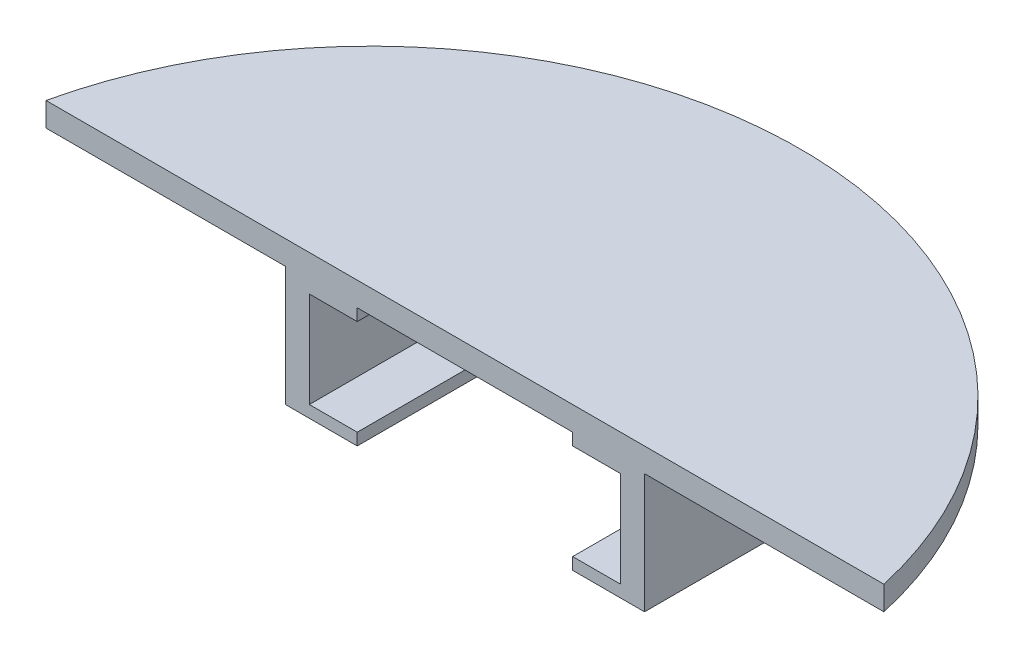
ISO-10303-21;
HEADER;
FILE_DESCRIPTION(('STEP AP214'),'2;1');
FILE_NAME('part.step','',(''),(''),'','','');
FILE_SCHEMA(('AUTOMOTIVE_DESIGN { 1 0 10303 214 1 1 1 1 }'));
ENDSEC;
DATA;
#1=APPLICATION_CONTEXT('core data for automotive mechanical design processes');
#2=APPLICATION_PROTOCOL_DEFINITION('international standard','automotive_design',2000,#1);
#3=PRODUCT_CONTEXT('',#1,'mechanical');
#4=PRODUCT('Part','Part','',(#3));
#5=PRODUCT_RELATED_PRODUCT_CATEGORY('part','',(#4));
#6=PRODUCT_DEFINITION_FORMATION('','',#4);
#7=PRODUCT_DEFINITION_CONTEXT('part definition',#1,'design');
#8=PRODUCT_DEFINITION('design','',#6,#7);
#9=PRODUCT_DEFINITION_SHAPE('','',#8);
#10=(LENGTH_UNIT() NAMED_UNIT(*) SI_UNIT(.MILLI.,.METRE.));
#11=(NAMED_UNIT(*) PLANE_ANGLE_UNIT() SI_UNIT($,.RADIAN.));
#12=(NAMED_UNIT(*) SI_UNIT($,.STERADIAN.) SOLID_ANGLE_UNIT());
#13=UNCERTAINTY_MEASURE_WITH_UNIT(LENGTH_MEASURE(1.E-05),#10,'distance_accuracy_value','');
#14=(GEOMETRIC_REPRESENTATION_CONTEXT(3) GLOBAL_UNCERTAINTY_ASSIGNED_CONTEXT((#13)) GLOBAL_UNIT_ASSIGNED_CONTEXT((#10,
#11,#12)) REPRESENTATION_CONTEXT('',''));
#15=CARTESIAN_POINT('',(0.,0.,0.));
#16=DIRECTION('',(0.,0.,1.));
#17=DIRECTION('',(1.,0.,0.));
#18=AXIS2_PLACEMENT_3D('',#15,#16,#17);
#19=CARTESIAN_POINT('',(0.,0.,0.));
#20=DIRECTION('',(0.,1.,0.));
#21=DIRECTION('',(0.,0.,1.));
#22=AXIS2_PLACEMENT_3D('',#19,#20,#21);
#23=PLANE('',#22);
#24=DIRECTION('',(0.,0.,1.));
#25=VECTOR('',#24,1.);
#26=CARTESIAN_POINT('',(-9.,0.,0.));
#27=LINE('',#26,#25);
#28=CARTESIAN_POINT('',(-9.,0.,0.));
#29=VERTEX_POINT('',#28);
#30=CARTESIAN_POINT('',(-9.,0.,13.));
#31=VERTEX_POINT('',#30);
#32=EDGE_CURVE('E87',#29,#31,#27,.T.);
#33=ORIENTED_EDGE('',*,*,#32,.F.);
#34=CARTESIAN_POINT('',(0.,0.,0.));
#35=DIRECTION('',(0.,1.,0.));
#36=DIRECTION('',(0.,0.,1.));
#37=AXIS2_PLACEMENT_3D('',#34,#35,#36);
#38=CIRCLE('',#37,9.);
#39=CARTESIAN_POINT('',(9.,0.,0.));
#40=VERTEX_POINT('',#39);
#41=EDGE_CURVE('E92',#40,#29,#38,.T.);
#42=ORIENTED_EDGE('',*,*,#41,.F.);
#43=DIRECTION('',(0.,0.,1.));
#44=VECTOR('',#43,1.);
#45=CARTESIAN_POINT('',(9.,0.,0.));
#46=LINE('',#45,#44);
#47=CARTESIAN_POINT('',(9.,0.,13.));
#48=VERTEX_POINT('',#47);
#49=EDGE_CURVE('E310',#40,#48,#46,.T.);
#50=ORIENTED_EDGE('',*,*,#49,.T.);
#51=DIRECTION('',(1.,0.,0.));
#52=VECTOR('',#51,1.);
#53=CARTESIAN_POINT('',(0.,0.,13.));
#54=LINE('',#53,#52);
#55=EDGE_CURVE('E385',#31,#48,#54,.T.);
#56=ORIENTED_EDGE('',*,*,#55,.F.);
#57=EDGE_LOOP('',(#33,#42,#50,#56));
#58=FACE_BOUND('',#57,.T.);
#59=ADVANCED_FACE('F69',(#58),#23,.F.);
#60=CARTESIAN_POINT('',(13.,-9.,0.));
#61=DIRECTION('',(-1.,0.,0.));
#62=DIRECTION('',(0.,0.,1.));
#63=AXIS2_PLACEMENT_3D('',#60,#61,#62);
#64=PLANE('',#63);
#65=DIRECTION('',(0.,1.,0.));
#66=VECTOR('',#65,1.);
#67=CARTESIAN_POINT('',(13.,-9.,13.));
#68=LINE('',#67,#66);
#69=CARTESIAN_POINT('',(13.,-9.,13.));
#70=VERTEX_POINT('',#69);
#71=CARTESIAN_POINT('',(13.,-0.999999999999999,13.));
#72=VERTEX_POINT('',#71);
#73=EDGE_CURVE('E210',#70,#72,#68,.T.);
#74=ORIENTED_EDGE('',*,*,#73,.T.);
#75=DIRECTION('',(0.,0.,1.));
#76=VECTOR('',#75,1.);
#77=CARTESIAN_POINT('',(13.,-1.,0.));
#78=LINE('',#77,#76);
#79=CARTESIAN_POINT('',(13.,-0.999999999999999,0.));
#80=VERTEX_POINT('',#79);
#81=EDGE_CURVE('E292',#80,#72,#78,.T.);
#82=ORIENTED_EDGE('',*,*,#81,.F.);
#83=DIRECTION('',(0.,1.,0.));
#84=VECTOR('',#83,1.);
#85=CARTESIAN_POINT('',(13.,-9.,0.));
#86=LINE('',#85,#84);
#87=CARTESIAN_POINT('',(13.,-9.,0.));
#88=VERTEX_POINT('',#87);
#89=EDGE_CURVE('E351',#88,#80,#86,.T.);
#90=ORIENTED_EDGE('',*,*,#89,.F.);
#91=DIRECTION('',(0.,0.,1.));
#92=VECTOR('',#91,1.);
#93=CARTESIAN_POINT('',(13.,-9.,0.));
#94=LINE('',#93,#92);
#95=EDGE_CURVE('E335',#88,#70,#94,.T.);
#96=ORIENTED_EDGE('',*,*,#95,.T.);
#97=EDGE_LOOP('',(#74,#82,#90,#96));
#98=FACE_BOUND('',#97,.T.);
#99=ADVANCED_FACE('F425',(#98),#64,.T.);
#100=CARTESIAN_POINT('',(0.,-9.,0.));
#101=DIRECTION('',(0.,1.,0.));
#102=DIRECTION('',(0.,0.,1.));
#103=AXIS2_PLACEMENT_3D('',#100,#101,#102);
#104=CYLINDRICAL_SURFACE('',#103,13.);
#105=CARTESIAN_POINT('',(0.,-1.,0.));
#106=DIRECTION('',(0.,1.,0.));
#107=DIRECTION('',(0.,0.,1.));
#108=AXIS2_PLACEMENT_3D('',#105,#106,#107);
#109=CIRCLE('',#108,13.);
#110=CARTESIAN_POINT('',(-13.,-1.,0.));
#111=VERTEX_POINT('',#110);
#112=EDGE_CURVE('E297',#80,#111,#109,.T.);
#113=ORIENTED_EDGE('',*,*,#112,.T.);
#114=DIRECTION('',(0.,1.,0.));
#115=VECTOR('',#114,1.);
#116=CARTESIAN_POINT('',(-13.,-9.,0.));
#117=LINE('',#116,#115);
#118=CARTESIAN_POINT('',(-13.,-9.,0.));
#119=VERTEX_POINT('',#118);
#120=EDGE_CURVE('E355',#119,#111,#117,.T.);
#121=ORIENTED_EDGE('',*,*,#120,.F.);
#122=CARTESIAN_POINT('',(0.,-9.,0.));
#123=DIRECTION('',(0.,1.,0.));
#124=DIRECTION('',(0.,0.,1.));
#125=AXIS2_PLACEMENT_3D('',#122,#123,#124);
#126=CIRCLE('',#125,13.);
#127=EDGE_CURVE('E331',#88,#119,#126,.T.);
#128=ORIENTED_EDGE('',*,*,#127,.F.);
#129=ORIENTED_EDGE('',*,*,#89,.T.);
#130=EDGE_LOOP('',(#113,#121,#128,#129));
#131=FACE_BOUND('',#130,.T.);
#132=ADVANCED_FACE('F428',(#131),#104,.F.);
#133=CARTESIAN_POINT('',(-13.,-9.,0.));
#134=DIRECTION('',(-1.,0.,0.));
#135=DIRECTION('',(0.,0.,1.));
#136=AXIS2_PLACEMENT_3D('',#133,#134,#135);
#137=PLANE('',#136);
#138=DIRECTION('',(0.,0.,1.));
#139=VECTOR('',#138,1.);
#140=CARTESIAN_POINT('',(-13.,-1.,0.));
#141=LINE('',#140,#139);
#142=CARTESIAN_POINT('',(-13.,-0.999999999999999,13.));
#143=VERTEX_POINT('',#142);
#144=EDGE_CURVE('E301',#111,#143,#141,.T.);
#145=ORIENTED_EDGE('',*,*,#144,.T.);
#146=DIRECTION('',(0.,1.,0.));
#147=VECTOR('',#146,1.);
#148=CARTESIAN_POINT('',(-13.,-9.,13.));
#149=LINE('',#148,#147);
#150=CARTESIAN_POINT('',(-13.,-9.,13.));
#151=VERTEX_POINT('',#150);
#152=EDGE_CURVE('E358',#151,#143,#149,.T.);
#153=ORIENTED_EDGE('',*,*,#152,.F.);
#154=DIRECTION('',(0.,0.,1.));
#155=VECTOR('',#154,1.);
#156=CARTESIAN_POINT('',(-13.,-9.,0.));
#157=LINE('',#156,#155);
#158=EDGE_CURVE('E327',#119,#151,#157,.T.);
#159=ORIENTED_EDGE('',*,*,#158,.F.);
#160=ORIENTED_EDGE('',*,*,#120,.T.);
#161=EDGE_LOOP('',(#145,#153,#159,#160));
#162=FACE_BOUND('',#161,.T.);
#163=ADVANCED_FACE('F471',(#162),#137,.F.);
#164=CARTESIAN_POINT('',(0.,0.,0.));
#165=DIRECTION('',(0.,1.,0.));
#166=DIRECTION('',(0.,0.,1.));
#167=AXIS2_PLACEMENT_3D('',#164,#165,#166);
#168=CIRCLE('',#167,15.);
#169=CARTESIAN_POINT('',(0.,0.,-15.));
#170=VERTEX_POINT('',#169);
#171=CARTESIAN_POINT('',(-15.,0.,0.));
#172=VERTEX_POINT('',#171);
#173=EDGE_CURVE('E12',#170,#172,#168,.T.);
#174=ORIENTED_EDGE('',*,*,#173,.T.);
#175=DIRECTION('',(0.,0.,1.));
#176=VECTOR('',#175,1.);
#177=CARTESIAN_POINT('',(-15.,0.,0.));
#178=LINE('',#177,#176);
#179=CARTESIAN_POINT('',(-15.,0.,13.));
#180=VERTEX_POINT('',#179);
#181=EDGE_CURVE('E341',#172,#180,#178,.T.);
#182=ORIENTED_EDGE('',*,*,#181,.T.);
#183=CARTESIAN_POINT('',(-35.,0.,13.));
#184=VERTEX_POINT('',#183);
#185=EDGE_CURVE('E373',#184,#180,#54,.T.);
#186=ORIENTED_EDGE('',*,*,#185,.F.);
#187=CARTESIAN_POINT('',(0.,0.,20.875));
#188=DIRECTION('',(0.,1.,0.));
#189=DIRECTION('',(0.,0.,1.));
#190=AXIS2_PLACEMENT_3D('',#187,#188,#189);
#191=CIRCLE('',#190,35.875);
#192=EDGE_CURVE('E378',#184,#170,#191,.F.);
#193=ORIENTED_EDGE('',*,*,#192,.T.);
#194=EDGE_LOOP('',(#174,#182,#186,#193));
#195=FACE_BOUND('',#194,.T.);
#196=ADVANCED_FACE('F454',(#195),#23,.F.);
#197=DIRECTION('',(0.,0.,1.));
#198=VECTOR('',#197,1.);
#199=CARTESIAN_POINT('',(15.,0.,0.));
#200=LINE('',#199,#198);
#201=CARTESIAN_POINT('',(15.,0.,0.));
#202=VERTEX_POINT('',#201);
#203=CARTESIAN_POINT('',(15.,0.,13.));
#204=VERTEX_POINT('',#203);
#205=EDGE_CURVE('E205',#202,#204,#200,.T.);
#206=ORIENTED_EDGE('',*,*,#205,.F.);
#207=EDGE_CURVE('E80',#202,#170,#168,.T.);
#208=ORIENTED_EDGE('',*,*,#207,.T.);
#209=CARTESIAN_POINT('',(35.,0.,13.));
#210=VERTEX_POINT('',#209);
#211=EDGE_CURVE('E347',#170,#210,#191,.F.);
#212=ORIENTED_EDGE('',*,*,#211,.T.);
#213=EDGE_CURVE('E382',#204,#210,#54,.T.);
#214=ORIENTED_EDGE('',*,*,#213,.F.);
#215=EDGE_LOOP('',(#206,#208,#212,#214));
#216=FACE_BOUND('',#215,.T.);
#217=ADVANCED_FACE('F399',(#216),#23,.F.);
#218=CARTESIAN_POINT('',(0.,2.,13.));
#219=DIRECTION('',(0.,0.,-1.));
#220=DIRECTION('',(-1.,0.,0.));
#221=AXIS2_PLACEMENT_3D('',#218,#219,#220);
#222=PLANE('',#221);
#223=DIRECTION('',(0.,1.,0.));
#224=VECTOR('',#223,1.);
#225=CARTESIAN_POINT('',(-9.,-1.,13.));
#226=LINE('',#225,#224);
#227=CARTESIAN_POINT('',(-9.,-1.,13.));
#228=VERTEX_POINT('',#227);
#229=EDGE_CURVE('E318',#228,#31,#226,.T.);
#230=ORIENTED_EDGE('',*,*,#229,.T.);
#231=ORIENTED_EDGE('',*,*,#55,.T.);
#232=DIRECTION('',(0.,1.,0.));
#233=VECTOR('',#232,1.);
#234=CARTESIAN_POINT('',(9.,-1.,13.));
#235=LINE('',#234,#233);
#236=CARTESIAN_POINT('',(9.,-1.,13.));
#237=VERTEX_POINT('',#236);
#238=EDGE_CURVE('E321',#237,#48,#235,.T.);
#239=ORIENTED_EDGE('',*,*,#238,.F.);
#240=DIRECTION('',(1.,0.,0.));
#241=VECTOR('',#240,1.);
#242=CARTESIAN_POINT('',(0.,-1.,13.));
#243=LINE('',#242,#241);
#244=EDGE_CURVE('E288',#237,#72,#243,.T.);
#245=ORIENTED_EDGE('',*,*,#244,.T.);
#246=ORIENTED_EDGE('',*,*,#73,.F.);
#247=DIRECTION('',(1.,0.,0.));
#248=VECTOR('',#247,1.);
#249=CARTESIAN_POINT('',(0.,-9.,13.));
#250=LINE('',#249,#248);
#251=CARTESIAN_POINT('',(9.,-9.,13.));
#252=VERTEX_POINT('',#251);
#253=EDGE_CURVE('E251',#252,#70,#250,.T.);
#254=ORIENTED_EDGE('',*,*,#253,.F.);
#255=DIRECTION('',(0.,1.,0.));
#256=VECTOR('',#255,1.);
#257=CARTESIAN_POINT('',(9.,-10.,13.));
#258=LINE('',#257,#256);
#259=CARTESIAN_POINT('',(9.,-10.,13.));
#260=VERTEX_POINT('',#259);
#261=EDGE_CURVE('E227',#260,#252,#258,.T.);
#262=ORIENTED_EDGE('',*,*,#261,.F.);
#263=DIRECTION('',(1.,0.,0.));
#264=VECTOR('',#263,1.);
#265=CARTESIAN_POINT('',(0.,-10.,13.));
#266=LINE('',#265,#264);
#267=CARTESIAN_POINT('',(15.,-10.,13.));
#268=VERTEX_POINT('',#267);
#269=EDGE_CURVE('E216',#260,#268,#266,.T.);
#270=ORIENTED_EDGE('',*,*,#269,.T.);
#271=DIRECTION('',(0.,1.,0.));
#272=VECTOR('',#271,1.);
#273=CARTESIAN_POINT('',(15.,-9.,13.));
#274=LINE('',#273,#272);
#275=EDGE_CURVE('E199',#268,#204,#274,.T.);
#276=ORIENTED_EDGE('',*,*,#275,.T.);
#277=ORIENTED_EDGE('',*,*,#213,.T.);
#278=DIRECTION('',(0.,-1.,0.));
#279=VECTOR('',#278,1.);
#280=CARTESIAN_POINT('',(35.,2.,13.));
#281=LINE('',#280,#279);
#282=CARTESIAN_POINT('',(35.,2.,13.));
#283=VERTEX_POINT('',#282);
#284=EDGE_CURVE('E73',#283,#210,#281,.T.);
#285=ORIENTED_EDGE('',*,*,#284,.F.);
#286=DIRECTION('',(1.,0.,0.));
#287=VECTOR('',#286,1.);
#288=CARTESIAN_POINT('',(0.,2.,13.));
#289=LINE('',#288,#287);
#290=CARTESIAN_POINT('',(-35.,2.,13.));
#291=VERTEX_POINT('',#290);
#292=EDGE_CURVE('E369',#291,#283,#289,.T.);
#293=ORIENTED_EDGE('',*,*,#292,.F.);
#294=DIRECTION('',(0.,-1.,0.));
#295=VECTOR('',#294,1.);
#296=CARTESIAN_POINT('',(-35.,2.,13.));
#297=LINE('',#296,#295);
#298=EDGE_CURVE('E377',#291,#184,#297,.T.);
#299=ORIENTED_EDGE('',*,*,#298,.T.);
#300=ORIENTED_EDGE('',*,*,#185,.T.);
#301=DIRECTION('',(0.,1.,0.));
#302=VECTOR('',#301,1.);
#303=CARTESIAN_POINT('',(-15.,-9.,13.));
#304=LINE('',#303,#302);
#305=CARTESIAN_POINT('',(-15.,-10.,13.));
#306=VERTEX_POINT('',#305);
#307=EDGE_CURVE('E362',#306,#180,#304,.T.);
#308=ORIENTED_EDGE('',*,*,#307,.F.);
#309=DIRECTION('',(1.,0.,0.));
#310=VECTOR('',#309,1.);
#311=CARTESIAN_POINT('',(0.,-10.,13.));
#312=LINE('',#311,#310);
#313=CARTESIAN_POINT('',(-9.,-10.,13.));
#314=VERTEX_POINT('',#313);
#315=EDGE_CURVE('E240',#306,#314,#312,.T.);
#316=ORIENTED_EDGE('',*,*,#315,.T.);
#317=DIRECTION('',(0.,1.,0.));
#318=VECTOR('',#317,1.);
#319=CARTESIAN_POINT('',(-9.,-10.,13.));
#320=LINE('',#319,#318);
#321=CARTESIAN_POINT('',(-9.,-9.,13.));
#322=VERTEX_POINT('',#321);
#323=EDGE_CURVE('E250',#314,#322,#320,.T.);
#324=ORIENTED_EDGE('',*,*,#323,.T.);
#325=DIRECTION('',(1.,0.,0.));
#326=VECTOR('',#325,1.);
#327=CARTESIAN_POINT('',(0.,-9.,13.));
#328=LINE('',#327,#326);
#329=EDGE_CURVE('E222',#151,#322,#328,.T.);
#330=ORIENTED_EDGE('',*,*,#329,.F.);
#331=ORIENTED_EDGE('',*,*,#152,.T.);
#332=EDGE_CURVE('E293',#143,#228,#243,.T.);
#333=ORIENTED_EDGE('',*,*,#332,.T.);
#334=EDGE_LOOP('',(#230,#231,#239,#245,#246,#254,#262,#270,#276,#277,#285,#293,#299,#300,#308,
#316,#324,#330,#331,#333));
#335=FACE_BOUND('',#334,.T.);
#336=ADVANCED_FACE('F225',(#335),#222,.F.);
#337=CARTESIAN_POINT('',(0.,2.,20.875));
#338=DIRECTION('',(0.,-1.,0.));
#339=DIRECTION('',(0.,0.,-1.));
#340=AXIS2_PLACEMENT_3D('',#337,#338,#339);
#341=CYLINDRICAL_SURFACE('',#340,35.875);
#342=ORIENTED_EDGE('',*,*,#192,.F.);
#343=ORIENTED_EDGE('',*,*,#298,.F.);
#344=CARTESIAN_POINT('',(0.,2.,20.875));
#345=DIRECTION('',(0.,1.,0.));
#346=DIRECTION('',(0.,0.,1.));
#347=AXIS2_PLACEMENT_3D('',#344,#345,#346);
#348=CIRCLE('',#347,35.875);
#349=EDGE_CURVE('E372',#291,#283,#348,.F.);
#350=ORIENTED_EDGE('',*,*,#349,.T.);
#351=ORIENTED_EDGE('',*,*,#284,.T.);
#352=ORIENTED_EDGE('',*,*,#211,.F.);
#353=EDGE_LOOP('',(#342,#343,#350,#351,#352));
#354=FACE_BOUND('',#353,.T.);
#355=ADVANCED_FACE('F71',(#354),#341,.T.);
#356=CARTESIAN_POINT('',(0.,2.,0.));
#357=DIRECTION('',(0.,1.,0.));
#358=DIRECTION('',(0.,0.,1.));
#359=AXIS2_PLACEMENT_3D('',#356,#357,#358);
#360=PLANE('',#359);
#361=ORIENTED_EDGE('',*,*,#349,.F.);
#362=ORIENTED_EDGE('',*,*,#292,.T.);
#363=EDGE_LOOP('',(#361,#362));
#364=FACE_BOUND('',#363,.T.);
#365=ADVANCED_FACE('F456',(#364),#360,.T.);
#366=CARTESIAN_POINT('',(0.,-9.,0.));
#367=DIRECTION('',(0.,1.,0.));
#368=DIRECTION('',(0.,0.,1.));
#369=AXIS2_PLACEMENT_3D('',#366,#367,#368);
#370=CYLINDRICAL_SURFACE('',#369,15.);
#371=ORIENTED_EDGE('',*,*,#207,.F.);
#372=DIRECTION('',(0.,1.,0.));
#373=VECTOR('',#372,1.);
#374=CARTESIAN_POINT('',(15.,-9.,0.));
#375=LINE('',#374,#373);
#376=CARTESIAN_POINT('',(15.,-10.,0.));
#377=VERTEX_POINT('',#376);
#378=EDGE_CURVE('E209',#377,#202,#375,.T.);
#379=ORIENTED_EDGE('',*,*,#378,.F.);
#380=CARTESIAN_POINT('',(0.,-10.,0.));
#381=DIRECTION('',(0.,1.,0.));
#382=DIRECTION('',(0.,0.,1.));
#383=AXIS2_PLACEMENT_3D('',#380,#381,#382);
#384=CIRCLE('',#383,15.);
#385=CARTESIAN_POINT('',(-15.,-10.,0.));
#386=VERTEX_POINT('',#385);
#387=EDGE_CURVE('E220',#377,#386,#384,.T.);
#388=ORIENTED_EDGE('',*,*,#387,.T.);
#389=DIRECTION('',(0.,1.,0.));
#390=VECTOR('',#389,1.);
#391=CARTESIAN_POINT('',(-15.,-9.,0.));
#392=LINE('',#391,#390);
#393=EDGE_CURVE('E338',#386,#172,#392,.T.);
#394=ORIENTED_EDGE('',*,*,#393,.T.);
#395=ORIENTED_EDGE('',*,*,#173,.F.);
#396=EDGE_LOOP('',(#371,#379,#388,#394,#395));
#397=FACE_BOUND('',#396,.T.);
#398=ADVANCED_FACE('F452',(#397),#370,.T.);
#399=CARTESIAN_POINT('',(15.,-9.,0.));
#400=DIRECTION('',(-1.,0.,0.));
#401=DIRECTION('',(0.,0.,1.));
#402=AXIS2_PLACEMENT_3D('',#399,#400,#401);
#403=PLANE('',#402);
#404=ORIENTED_EDGE('',*,*,#205,.T.);
#405=ORIENTED_EDGE('',*,*,#275,.F.);
#406=DIRECTION('',(0.,0.,1.));
#407=VECTOR('',#406,1.);
#408=CARTESIAN_POINT('',(15.,-10.,0.));
#409=LINE('',#408,#407);
#410=EDGE_CURVE('E203',#377,#268,#409,.T.);
#411=ORIENTED_EDGE('',*,*,#410,.F.);
#412=ORIENTED_EDGE('',*,*,#378,.T.);
#413=EDGE_LOOP('',(#404,#405,#411,#412));
#414=FACE_BOUND('',#413,.T.);
#415=ADVANCED_FACE('F201',(#414),#403,.F.);
#416=CARTESIAN_POINT('',(-15.,-9.,0.));
#417=DIRECTION('',(-1.,0.,0.));
#418=DIRECTION('',(0.,0.,1.));
#419=AXIS2_PLACEMENT_3D('',#416,#417,#418);
#420=PLANE('',#419);
#421=ORIENTED_EDGE('',*,*,#181,.F.);
#422=ORIENTED_EDGE('',*,*,#393,.F.);
#423=DIRECTION('',(0.,0.,1.));
#424=VECTOR('',#423,1.);
#425=CARTESIAN_POINT('',(-15.,-10.,0.));
#426=LINE('',#425,#424);
#427=EDGE_CURVE('E244',#386,#306,#426,.T.);
#428=ORIENTED_EDGE('',*,*,#427,.T.);
#429=ORIENTED_EDGE('',*,*,#307,.T.);
#430=EDGE_LOOP('',(#421,#422,#428,#429));
#431=FACE_BOUND('',#430,.T.);
#432=ADVANCED_FACE('F449',(#431),#420,.T.);
#433=CARTESIAN_POINT('',(0.,-1.,0.));
#434=DIRECTION('',(0.,1.,0.));
#435=DIRECTION('',(0.,0.,1.));
#436=AXIS2_PLACEMENT_3D('',#433,#434,#435);
#437=CYLINDRICAL_SURFACE('',#436,9.);
#438=ORIENTED_EDGE('',*,*,#41,.T.);
#439=DIRECTION('',(0.,1.,0.));
#440=VECTOR('',#439,1.);
#441=CARTESIAN_POINT('',(-9.,-1.,0.));
#442=LINE('',#441,#440);
#443=CARTESIAN_POINT('',(-9.,-1.,0.));
#444=VERTEX_POINT('',#443);
#445=EDGE_CURVE('E315',#444,#29,#442,.T.);
#446=ORIENTED_EDGE('',*,*,#445,.F.);
#447=CARTESIAN_POINT('',(0.,-1.,0.));
#448=DIRECTION('',(0.,1.,0.));
#449=DIRECTION('',(0.,0.,1.));
#450=AXIS2_PLACEMENT_3D('',#447,#448,#449);
#451=CIRCLE('',#450,9.);
#452=CARTESIAN_POINT('',(9.,-1.,0.));
#453=VERTEX_POINT('',#452);
#454=EDGE_CURVE('E280',#453,#444,#451,.T.);
#455=ORIENTED_EDGE('',*,*,#454,.F.);
#456=DIRECTION('',(0.,1.,0.));
#457=VECTOR('',#456,1.);
#458=CARTESIAN_POINT('',(9.,-1.,0.));
#459=LINE('',#458,#457);
#460=EDGE_CURVE('E307',#453,#40,#459,.T.);
#461=ORIENTED_EDGE('',*,*,#460,.T.);
#462=EDGE_LOOP('',(#438,#446,#455,#461));
#463=FACE_BOUND('',#462,.T.);
#464=ADVANCED_FACE('F418',(#463),#437,.F.);
#465=CARTESIAN_POINT('',(-9.,-1.,0.));
#466=DIRECTION('',(-1.,0.,0.));
#467=DIRECTION('',(0.,0.,1.));
#468=AXIS2_PLACEMENT_3D('',#465,#466,#467);
#469=PLANE('',#468);
#470=ORIENTED_EDGE('',*,*,#32,.T.);
#471=ORIENTED_EDGE('',*,*,#229,.F.);
#472=DIRECTION('',(0.,0.,1.));
#473=VECTOR('',#472,1.);
#474=CARTESIAN_POINT('',(-9.,-1.,0.));
#475=LINE('',#474,#473);
#476=EDGE_CURVE('E304',#444,#228,#475,.T.);
#477=ORIENTED_EDGE('',*,*,#476,.F.);
#478=ORIENTED_EDGE('',*,*,#445,.T.);
#479=EDGE_LOOP('',(#470,#471,#477,#478));
#480=FACE_BOUND('',#479,.T.);
#481=ADVANCED_FACE('F416',(#480),#469,.F.);
#482=CARTESIAN_POINT('',(9.,-1.,0.));
#483=DIRECTION('',(-1.,0.,0.));
#484=DIRECTION('',(0.,0.,1.));
#485=AXIS2_PLACEMENT_3D('',#482,#483,#484);
#486=PLANE('',#485);
#487=ORIENTED_EDGE('',*,*,#49,.F.);
#488=ORIENTED_EDGE('',*,*,#460,.F.);
#489=DIRECTION('',(0.,0.,1.));
#490=VECTOR('',#489,1.);
#491=CARTESIAN_POINT('',(9.,-1.,0.));
#492=LINE('',#491,#490);
#493=EDGE_CURVE('E284',#453,#237,#492,.T.);
#494=ORIENTED_EDGE('',*,*,#493,.T.);
#495=ORIENTED_EDGE('',*,*,#238,.T.);
#496=EDGE_LOOP('',(#487,#488,#494,#495));
#497=FACE_BOUND('',#496,.T.);
#498=ADVANCED_FACE('F421',(#497),#486,.T.);
#499=CARTESIAN_POINT('',(0.,-1.,0.));
#500=DIRECTION('',(0.,1.,0.));
#501=DIRECTION('',(0.,0.,1.));
#502=AXIS2_PLACEMENT_3D('',#499,#500,#501);
#503=PLANE('',#502);
#504=ORIENTED_EDGE('',*,*,#454,.T.);
#505=ORIENTED_EDGE('',*,*,#476,.T.);
#506=ORIENTED_EDGE('',*,*,#332,.F.);
#507=ORIENTED_EDGE('',*,*,#144,.F.);
#508=ORIENTED_EDGE('',*,*,#112,.F.);
#509=ORIENTED_EDGE('',*,*,#81,.T.);
#510=ORIENTED_EDGE('',*,*,#244,.F.);
#511=ORIENTED_EDGE('',*,*,#493,.F.);
#512=EDGE_LOOP('',(#504,#505,#506,#507,#508,#509,#510,#511));
#513=FACE_BOUND('',#512,.T.);
#514=ADVANCED_FACE('F410',(#513),#503,.F.);
#515=CARTESIAN_POINT('',(0.,-9.,0.));
#516=DIRECTION('',(0.,1.,0.));
#517=DIRECTION('',(0.,0.,1.));
#518=AXIS2_PLACEMENT_3D('',#515,#516,#517);
#519=PLANE('',#518);
#520=ORIENTED_EDGE('',*,*,#95,.F.);
#521=ORIENTED_EDGE('',*,*,#127,.T.);
#522=ORIENTED_EDGE('',*,*,#158,.T.);
#523=ORIENTED_EDGE('',*,*,#329,.T.);
#524=DIRECTION('',(0.,0.,1.));
#525=VECTOR('',#524,1.);
#526=CARTESIAN_POINT('',(-9.,-9.,0.));
#527=LINE('',#526,#525);
#528=CARTESIAN_POINT('',(-9.,-9.,0.));
#529=VERTEX_POINT('',#528);
#530=EDGE_CURVE('E262',#529,#322,#527,.T.);
#531=ORIENTED_EDGE('',*,*,#530,.F.);
#532=CARTESIAN_POINT('',(0.,-9.,0.));
#533=DIRECTION('',(0.,1.,0.));
#534=DIRECTION('',(0.,0.,1.));
#535=AXIS2_PLACEMENT_3D('',#532,#533,#534);
#536=CIRCLE('',#535,9.);
#537=CARTESIAN_POINT('',(9.,-9.,0.));
#538=VERTEX_POINT('',#537);
#539=EDGE_CURVE('E259',#538,#529,#536,.T.);
#540=ORIENTED_EDGE('',*,*,#539,.F.);
#541=DIRECTION('',(0.,0.,1.));
#542=VECTOR('',#541,1.);
#543=CARTESIAN_POINT('',(9.,-9.,0.));
#544=LINE('',#543,#542);
#545=EDGE_CURVE('E255',#538,#252,#544,.T.);
#546=ORIENTED_EDGE('',*,*,#545,.T.);
#547=ORIENTED_EDGE('',*,*,#253,.T.);
#548=EDGE_LOOP('',(#520,#521,#522,#523,#531,#540,#546,#547));
#549=FACE_BOUND('',#548,.T.);
#550=ADVANCED_FACE('F432',(#549),#519,.T.);
#551=CARTESIAN_POINT('',(9.,-10.,0.));
#552=DIRECTION('',(-1.,0.,0.));
#553=DIRECTION('',(0.,0.,1.));
#554=AXIS2_PLACEMENT_3D('',#551,#552,#553);
#555=PLANE('',#554);
#556=ORIENTED_EDGE('',*,*,#545,.F.);
#557=DIRECTION('',(0.,1.,0.));
#558=VECTOR('',#557,1.);
#559=CARTESIAN_POINT('',(9.,-10.,0.));
#560=LINE('',#559,#558);
#561=CARTESIAN_POINT('',(9.,-10.,0.));
#562=VERTEX_POINT('',#561);
#563=EDGE_CURVE('E275',#562,#538,#560,.T.);
#564=ORIENTED_EDGE('',*,*,#563,.F.);
#565=DIRECTION('',(0.,0.,1.));
#566=VECTOR('',#565,1.);
#567=CARTESIAN_POINT('',(9.,-10.,0.));
#568=LINE('',#567,#566);
#569=EDGE_CURVE('E229',#562,#260,#568,.T.);
#570=ORIENTED_EDGE('',*,*,#569,.T.);
#571=ORIENTED_EDGE('',*,*,#261,.T.);
#572=EDGE_LOOP('',(#556,#564,#570,#571));
#573=FACE_BOUND('',#572,.T.);
#574=ADVANCED_FACE('F437',(#573),#555,.T.);
#575=CARTESIAN_POINT('',(0.,-10.,0.));
#576=DIRECTION('',(0.,1.,0.));
#577=DIRECTION('',(0.,0.,1.));
#578=AXIS2_PLACEMENT_3D('',#575,#576,#577);
#579=CYLINDRICAL_SURFACE('',#578,9.);
#580=ORIENTED_EDGE('',*,*,#539,.T.);
#581=DIRECTION('',(0.,1.,0.));
#582=VECTOR('',#581,1.);
#583=CARTESIAN_POINT('',(-9.,-10.,0.));
#584=LINE('',#583,#582);
#585=CARTESIAN_POINT('',(-9.,-10.,0.));
#586=VERTEX_POINT('',#585);
#587=EDGE_CURVE('E271',#586,#529,#584,.T.);
#588=ORIENTED_EDGE('',*,*,#587,.F.);
#589=CARTESIAN_POINT('',(0.,-10.,0.));
#590=DIRECTION('',(0.,1.,0.));
#591=DIRECTION('',(0.,0.,1.));
#592=AXIS2_PLACEMENT_3D('',#589,#590,#591);
#593=CIRCLE('',#592,9.);
#594=EDGE_CURVE('E232',#562,#586,#593,.T.);
#595=ORIENTED_EDGE('',*,*,#594,.F.);
#596=ORIENTED_EDGE('',*,*,#563,.T.);
#597=EDGE_LOOP('',(#580,#588,#595,#596));
#598=FACE_BOUND('',#597,.T.);
#599=ADVANCED_FACE('F444',(#598),#579,.F.);
#600=CARTESIAN_POINT('',(-9.,-10.,0.));
#601=DIRECTION('',(-1.,0.,0.));
#602=DIRECTION('',(0.,0.,1.));
#603=AXIS2_PLACEMENT_3D('',#600,#601,#602);
#604=PLANE('',#603);
#605=ORIENTED_EDGE('',*,*,#530,.T.);
#606=ORIENTED_EDGE('',*,*,#323,.F.);
#607=DIRECTION('',(0.,0.,1.));
#608=VECTOR('',#607,1.);
#609=CARTESIAN_POINT('',(-9.,-10.,0.));
#610=LINE('',#609,#608);
#611=EDGE_CURVE('E237',#586,#314,#610,.T.);
#612=ORIENTED_EDGE('',*,*,#611,.F.);
#613=ORIENTED_EDGE('',*,*,#587,.T.);
#614=EDGE_LOOP('',(#605,#606,#612,#613));
#615=FACE_BOUND('',#614,.T.);
#616=ADVANCED_FACE('F446',(#615),#604,.F.);
#617=CARTESIAN_POINT('',(0.,-10.,0.));
#618=DIRECTION('',(0.,1.,0.));
#619=DIRECTION('',(0.,0.,1.));
#620=AXIS2_PLACEMENT_3D('',#617,#618,#619);
#621=PLANE('',#620);
#622=ORIENTED_EDGE('',*,*,#410,.T.);
#623=ORIENTED_EDGE('',*,*,#269,.F.);
#624=ORIENTED_EDGE('',*,*,#569,.F.);
#625=ORIENTED_EDGE('',*,*,#594,.T.);
#626=ORIENTED_EDGE('',*,*,#611,.T.);
#627=ORIENTED_EDGE('',*,*,#315,.F.);
#628=ORIENTED_EDGE('',*,*,#427,.F.);
#629=ORIENTED_EDGE('',*,*,#387,.F.);
#630=EDGE_LOOP('',(#622,#623,#624,#625,#626,#627,#628,#629));
#631=FACE_BOUND('',#630,.T.);
#632=ADVANCED_FACE('F214',(#631),#621,.F.);
#633=CLOSED_SHELL('',(#59,#99,#132,#163,#196,#217,#336,#355,#365,#398,#415,#432,#464,#481,#498,
#514,#550,#574,#599,#616,#632));
#634=MANIFOLD_SOLID_BREP('B2',#633);
#635=ADVANCED_BREP_SHAPE_REPRESENTATION('',(#18,#634),#14);
#636=SHAPE_DEFINITION_REPRESENTATION(#9,#635);
ENDSEC;
END-ISO-10303-21;
